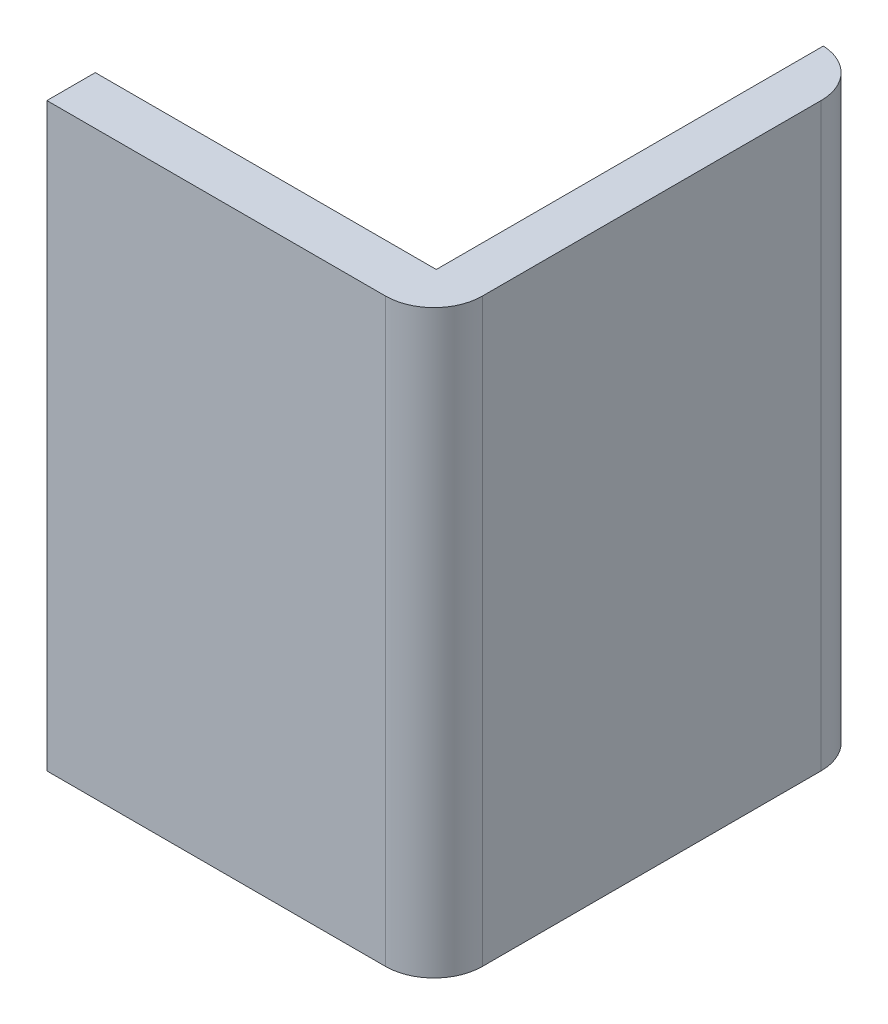
ISO-10303-21;
HEADER;
FILE_DESCRIPTION(('STEP AP214'),'2;1');
FILE_NAME('part.step','',(''),(''),'','','');
FILE_SCHEMA(('AUTOMOTIVE_DESIGN { 1 0 10303 214 1 1 1 1 }'));
ENDSEC;
DATA;
#1=APPLICATION_CONTEXT('core data for automotive mechanical design processes');
#2=APPLICATION_PROTOCOL_DEFINITION('international standard','automotive_design',2000,#1);
#3=PRODUCT_CONTEXT('',#1,'mechanical');
#4=PRODUCT('Part','Part','',(#3));
#5=PRODUCT_RELATED_PRODUCT_CATEGORY('part','',(#4));
#6=PRODUCT_DEFINITION_FORMATION('','',#4);
#7=PRODUCT_DEFINITION_CONTEXT('part definition',#1,'design');
#8=PRODUCT_DEFINITION('design','',#6,#7);
#9=PRODUCT_DEFINITION_SHAPE('','',#8);
#10=(LENGTH_UNIT() NAMED_UNIT(*) SI_UNIT(.MILLI.,.METRE.));
#11=(NAMED_UNIT(*) PLANE_ANGLE_UNIT() SI_UNIT($,.RADIAN.));
#12=(NAMED_UNIT(*) SI_UNIT($,.STERADIAN.) SOLID_ANGLE_UNIT());
#13=UNCERTAINTY_MEASURE_WITH_UNIT(LENGTH_MEASURE(1.E-05),#10,'distance_accuracy_value','');
#14=(GEOMETRIC_REPRESENTATION_CONTEXT(3) GLOBAL_UNCERTAINTY_ASSIGNED_CONTEXT((#13)) GLOBAL_UNIT_ASSIGNED_CONTEXT((#10,
#11,#12)) REPRESENTATION_CONTEXT('',''));
#15=CARTESIAN_POINT('',(0.,0.,0.));
#16=DIRECTION('',(0.,0.,1.));
#17=DIRECTION('',(1.,0.,0.));
#18=AXIS2_PLACEMENT_3D('',#15,#16,#17);
#19=CARTESIAN_POINT('',(0.8,0.,0.1));
#20=DIRECTION('',(-1.,0.,0.));
#21=DIRECTION('',(0.,-1.,0.));
#22=AXIS2_PLACEMENT_3D('',#19,#20,#21);
#23=PLANE('',#22);
#24=DIRECTION('',(0.,1.,0.));
#25=VECTOR('',#24,1.);
#26=CARTESIAN_POINT('',(0.8,1.2,0.));
#27=LINE('',#26,#25);
#28=CARTESIAN_POINT('',(0.8,0.,0.));
#29=VERTEX_POINT('',#28);
#30=CARTESIAN_POINT('',(0.8,1.2,0.));
#31=VERTEX_POINT('',#30);
#32=EDGE_CURVE('E78',#29,#31,#27,.T.);
#33=ORIENTED_EDGE('',*,*,#32,.F.);
#34=DIRECTION('',(0.,0.,1.));
#35=VECTOR('',#34,1.);
#36=CARTESIAN_POINT('',(0.8,0.,0.1));
#37=LINE('',#36,#35);
#38=CARTESIAN_POINT('',(0.8,0.,-0.700114195647));
#39=VERTEX_POINT('',#38);
#40=EDGE_CURVE('E80',#29,#39,#37,.F.);
#41=ORIENTED_EDGE('',*,*,#40,.T.);
#42=DIRECTION('',(0.,1.,0.));
#43=VECTOR('',#42,1.);
#44=CARTESIAN_POINT('',(0.8,1.2,-0.700114195647));
#45=LINE('',#44,#43);
#46=CARTESIAN_POINT('',(0.8,1.2,-0.700114195647));
#47=VERTEX_POINT('',#46);
#48=EDGE_CURVE('E92',#47,#39,#45,.F.);
#49=ORIENTED_EDGE('',*,*,#48,.F.);
#50=DIRECTION('',(0.,0.,-1.));
#51=VECTOR('',#50,1.);
#52=CARTESIAN_POINT('',(0.8,1.2,0.1));
#53=LINE('',#52,#51);
#54=EDGE_CURVE('E83',#47,#31,#53,.F.);
#55=ORIENTED_EDGE('',*,*,#54,.T.);
#56=EDGE_LOOP('',(#33,#41,#49,#55));
#57=FACE_BOUND('',#56,.T.);
#58=ADVANCED_FACE('F17',(#57),#23,.F.);
#59=CARTESIAN_POINT('',(0.7,1.2,0.));
#60=DIRECTION('',(0.,1.,0.));
#61=DIRECTION('',(-1.,0.,0.));
#62=AXIS2_PLACEMENT_3D('',#59,#60,#61);
#63=CYLINDRICAL_SURFACE('',#62,0.1);
#64=CARTESIAN_POINT('',(0.7,1.2,0.));
#65=DIRECTION('',(0.,1.,0.));
#66=DIRECTION('',(-1.,0.,0.));
#67=AXIS2_PLACEMENT_3D('',#64,#65,#66);
#68=CIRCLE('',#67,0.1);
#69=CARTESIAN_POINT('',(0.7,1.2,0.1));
#70=VERTEX_POINT('',#69);
#71=EDGE_CURVE('E129',#31,#70,#68,.F.);
#72=ORIENTED_EDGE('',*,*,#71,.T.);
#73=DIRECTION('',(0.,1.,0.));
#74=VECTOR('',#73,1.);
#75=CARTESIAN_POINT('',(0.7,1.2,0.1));
#76=LINE('',#75,#74);
#77=CARTESIAN_POINT('',(0.7,0.,0.1));
#78=VERTEX_POINT('',#77);
#79=EDGE_CURVE('E72',#70,#78,#76,.F.);
#80=ORIENTED_EDGE('',*,*,#79,.T.);
#81=CARTESIAN_POINT('',(0.7,0.,0.));
#82=DIRECTION('',(0.,1.,0.));
#83=DIRECTION('',(-1.,0.,0.));
#84=AXIS2_PLACEMENT_3D('',#81,#82,#83);
#85=CIRCLE('',#84,0.1);
#86=EDGE_CURVE('E20',#78,#29,#85,.T.);
#87=ORIENTED_EDGE('',*,*,#86,.T.);
#88=ORIENTED_EDGE('',*,*,#32,.T.);
#89=EDGE_LOOP('',(#72,#80,#87,#88));
#90=FACE_BOUND('',#89,.T.);
#91=ADVANCED_FACE('F94',(#90),#63,.T.);
#92=CARTESIAN_POINT('',(0.,1.2,0.1));
#93=DIRECTION('',(0.,0.,-1.));
#94=DIRECTION('',(-1.,0.,0.));
#95=AXIS2_PLACEMENT_3D('',#92,#93,#94);
#96=PLANE('',#95);
#97=ORIENTED_EDGE('',*,*,#79,.F.);
#98=DIRECTION('',(1.,0.,0.));
#99=VECTOR('',#98,1.);
#100=CARTESIAN_POINT('',(0.,1.2,0.1));
#101=LINE('',#100,#99);
#102=CARTESIAN_POINT('',(0.,1.2,0.1));
#103=VERTEX_POINT('',#102);
#104=EDGE_CURVE('E110',#70,#103,#101,.F.);
#105=ORIENTED_EDGE('',*,*,#104,.T.);
#106=DIRECTION('',(0.,1.,0.));
#107=VECTOR('',#106,1.);
#108=CARTESIAN_POINT('',(0.,0.,0.1));
#109=LINE('',#108,#107);
#110=CARTESIAN_POINT('',(0.,0.,0.1));
#111=VERTEX_POINT('',#110);
#112=EDGE_CURVE('E100',#103,#111,#109,.F.);
#113=ORIENTED_EDGE('',*,*,#112,.T.);
#114=DIRECTION('',(1.,0.,0.));
#115=VECTOR('',#114,1.);
#116=CARTESIAN_POINT('',(0.,0.,0.1));
#117=LINE('',#116,#115);
#118=EDGE_CURVE('E95',#111,#78,#117,.T.);
#119=ORIENTED_EDGE('',*,*,#118,.T.);
#120=EDGE_LOOP('',(#97,#105,#113,#119));
#121=FACE_BOUND('',#120,.T.);
#122=ADVANCED_FACE('F160',(#121),#96,.F.);
#123=CARTESIAN_POINT('',(0.,0.,0.1));
#124=DIRECTION('',(1.,0.,0.));
#125=DIRECTION('',(0.,1.,0.));
#126=AXIS2_PLACEMENT_3D('',#123,#124,#125);
#127=PLANE('',#126);
#128=DIRECTION('',(0.,0.,1.));
#129=VECTOR('',#128,1.);
#130=CARTESIAN_POINT('',(0.,0.,0.1));
#131=LINE('',#130,#129);
#132=CARTESIAN_POINT('',(0.,0.,0.));
#133=VERTEX_POINT('',#132);
#134=EDGE_CURVE('E96',#133,#111,#131,.T.);
#135=ORIENTED_EDGE('',*,*,#134,.T.);
#136=ORIENTED_EDGE('',*,*,#112,.F.);
#137=DIRECTION('',(0.,0.,-1.));
#138=VECTOR('',#137,1.);
#139=CARTESIAN_POINT('',(0.,1.2,0.1));
#140=LINE('',#139,#138);
#141=CARTESIAN_POINT('',(0.,1.2,0.));
#142=VERTEX_POINT('',#141);
#143=EDGE_CURVE('E113',#103,#142,#140,.T.);
#144=ORIENTED_EDGE('',*,*,#143,.T.);
#145=DIRECTION('',(0.,1.,0.));
#146=VECTOR('',#145,1.);
#147=CARTESIAN_POINT('',(0.,1.2,0.));
#148=LINE('',#147,#146);
#149=EDGE_CURVE('E109',#133,#142,#148,.T.);
#150=ORIENTED_EDGE('',*,*,#149,.F.);
#151=EDGE_LOOP('',(#135,#136,#144,#150));
#152=FACE_BOUND('',#151,.T.);
#153=ADVANCED_FACE('F166',(#152),#127,.F.);
#154=CARTESIAN_POINT('',(0.,0.,0.1));
#155=DIRECTION('',(0.,1.,0.));
#156=DIRECTION('',(0.,0.,1.));
#157=AXIS2_PLACEMENT_3D('',#154,#155,#156);
#158=PLANE('',#157);
#159=ORIENTED_EDGE('',*,*,#86,.F.);
#160=ORIENTED_EDGE('',*,*,#118,.F.);
#161=ORIENTED_EDGE('',*,*,#134,.F.);
#162=DIRECTION('',(-1.,0.,0.));
#163=VECTOR('',#162,1.);
#164=CARTESIAN_POINT('',(0.,0.,0.));
#165=LINE('',#164,#163);
#166=CARTESIAN_POINT('',(0.704777665616,0.,0.));
#167=VERTEX_POINT('',#166);
#168=EDGE_CURVE('E106',#167,#133,#165,.T.);
#169=ORIENTED_EDGE('',*,*,#168,.F.);
#170=DIRECTION('',(0.,0.,-1.));
#171=VECTOR('',#170,1.);
#172=CARTESIAN_POINT('',(0.704777665616,0.,-0.8));
#173=LINE('',#172,#171);
#174=CARTESIAN_POINT('',(0.704777665616,0.,-0.80000000000004));
#175=VERTEX_POINT('',#174);
#176=EDGE_CURVE('E140',#167,#175,#173,.T.);
#177=ORIENTED_EDGE('',*,*,#176,.T.);
#178=CARTESIAN_POINT('',(0.7,0.,-0.700114195647));
#179=DIRECTION('',(0.,1.,0.));
#180=DIRECTION('',(0.,0.,1.));
#181=AXIS2_PLACEMENT_3D('',#178,#179,#180);
#182=CIRCLE('',#181,0.1);
#183=EDGE_CURVE('E91',#39,#175,#182,.T.);
#184=ORIENTED_EDGE('',*,*,#183,.F.);
#185=ORIENTED_EDGE('',*,*,#40,.F.);
#186=EDGE_LOOP('',(#159,#160,#161,#169,#177,#184,#185));
#187=FACE_BOUND('',#186,.T.);
#188=ADVANCED_FACE('F87',(#187),#158,.F.);
#189=CARTESIAN_POINT('',(0.7,1.2,-0.700114195647));
#190=DIRECTION('',(0.,1.,0.));
#191=DIRECTION('',(0.,0.,1.));
#192=AXIS2_PLACEMENT_3D('',#189,#190,#191);
#193=CYLINDRICAL_SURFACE('',#192,0.1);
#194=ORIENTED_EDGE('',*,*,#183,.T.);
#195=DIRECTION('',(0.,1.,0.));
#196=VECTOR('',#195,1.);
#197=CARTESIAN_POINT('',(0.704777665616,0.,-0.8));
#198=LINE('',#197,#196);
#199=CARTESIAN_POINT('',(0.704777665616,1.2,-0.80000000000004));
#200=VERTEX_POINT('',#199);
#201=EDGE_CURVE('E136',#175,#200,#198,.T.);
#202=ORIENTED_EDGE('',*,*,#201,.T.);
#203=CARTESIAN_POINT('',(0.7,1.2,-0.700114195647));
#204=DIRECTION('',(0.,1.,0.));
#205=DIRECTION('',(0.,0.,1.));
#206=AXIS2_PLACEMENT_3D('',#203,#204,#205);
#207=CIRCLE('',#206,0.1);
#208=EDGE_CURVE('E116',#200,#47,#207,.F.);
#209=ORIENTED_EDGE('',*,*,#208,.T.);
#210=ORIENTED_EDGE('',*,*,#48,.T.);
#211=EDGE_LOOP('',(#194,#202,#209,#210));
#212=FACE_BOUND('',#211,.T.);
#213=ADVANCED_FACE('F135',(#212),#193,.T.);
#214=CARTESIAN_POINT('',(0.,1.2,0.1));
#215=DIRECTION('',(0.,-1.,0.));
#216=DIRECTION('',(0.,0.,-1.));
#217=AXIS2_PLACEMENT_3D('',#214,#215,#216);
#218=PLANE('',#217);
#219=ORIENTED_EDGE('',*,*,#71,.F.);
#220=ORIENTED_EDGE('',*,*,#54,.F.);
#221=ORIENTED_EDGE('',*,*,#208,.F.);
#222=DIRECTION('',(0.,0.,-1.));
#223=VECTOR('',#222,1.);
#224=CARTESIAN_POINT('',(0.704777665616,1.2,-0.8));
#225=LINE('',#224,#223);
#226=CARTESIAN_POINT('',(0.704777665616,1.2,0.));
#227=VERTEX_POINT('',#226);
#228=EDGE_CURVE('E26',#200,#227,#225,.F.);
#229=ORIENTED_EDGE('',*,*,#228,.T.);
#230=DIRECTION('',(-1.,0.,0.));
#231=VECTOR('',#230,1.);
#232=CARTESIAN_POINT('',(0.,1.2,0.));
#233=LINE('',#232,#231);
#234=EDGE_CURVE('E34',#142,#227,#233,.F.);
#235=ORIENTED_EDGE('',*,*,#234,.F.);
#236=ORIENTED_EDGE('',*,*,#143,.F.);
#237=ORIENTED_EDGE('',*,*,#104,.F.);
#238=EDGE_LOOP('',(#219,#220,#221,#229,#235,#236,#237));
#239=FACE_BOUND('',#238,.T.);
#240=ADVANCED_FACE('F163',(#239),#218,.F.);
#241=CARTESIAN_POINT('',(0.,1.2,0.));
#242=DIRECTION('',(0.,0.,-1.));
#243=DIRECTION('',(-1.,0.,0.));
#244=AXIS2_PLACEMENT_3D('',#241,#242,#243);
#245=PLANE('',#244);
#246=ORIENTED_EDGE('',*,*,#149,.T.);
#247=ORIENTED_EDGE('',*,*,#234,.T.);
#248=DIRECTION('',(0.,1.,0.));
#249=VECTOR('',#248,1.);
#250=CARTESIAN_POINT('',(0.704777665616,0.,0.));
#251=LINE('',#250,#249);
#252=EDGE_CURVE('E11',#227,#167,#251,.F.);
#253=ORIENTED_EDGE('',*,*,#252,.T.);
#254=ORIENTED_EDGE('',*,*,#168,.T.);
#255=EDGE_LOOP('',(#246,#247,#253,#254));
#256=FACE_BOUND('',#255,.T.);
#257=ADVANCED_FACE('F167',(#256),#245,.T.);
#258=CARTESIAN_POINT('',(0.704777665616,0.,-0.8));
#259=DIRECTION('',(1.,0.,0.));
#260=DIRECTION('',(0.,0.,-1.));
#261=AXIS2_PLACEMENT_3D('',#258,#259,#260);
#262=PLANE('',#261);
#263=ORIENTED_EDGE('',*,*,#228,.F.);
#264=ORIENTED_EDGE('',*,*,#201,.F.);
#265=ORIENTED_EDGE('',*,*,#176,.F.);
#266=ORIENTED_EDGE('',*,*,#252,.F.);
#267=EDGE_LOOP('',(#263,#264,#265,#266));
#268=FACE_BOUND('',#267,.T.);
#269=ADVANCED_FACE('F139',(#268),#262,.F.);
#270=CLOSED_SHELL('',(#58,#91,#122,#153,#188,#213,#240,#257,#269));
#271=MANIFOLD_SOLID_BREP('B1',#270);
#272=ADVANCED_BREP_SHAPE_REPRESENTATION('',(#18,#271),#14);
#273=SHAPE_DEFINITION_REPRESENTATION(#9,#272);
ENDSEC;
END-ISO-10303-21;
